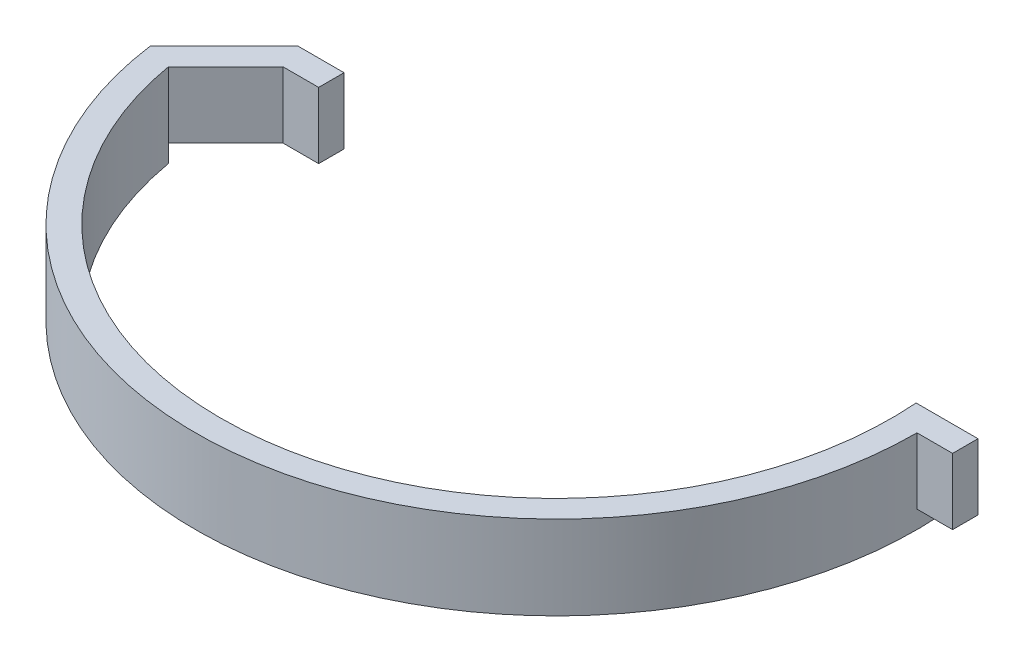
ISO-10303-21;
HEADER;
FILE_DESCRIPTION(('STEP AP214'),'2;1');
FILE_NAME('part.step','',(''),(''),'','','');
FILE_SCHEMA(('AUTOMOTIVE_DESIGN { 1 0 10303 214 1 1 1 1 }'));
ENDSEC;
DATA;
#1=APPLICATION_CONTEXT('core data for automotive mechanical design processes');
#2=APPLICATION_PROTOCOL_DEFINITION('international standard','automotive_design',2000,#1);
#3=PRODUCT_CONTEXT('',#1,'mechanical');
#4=PRODUCT('Part','Part','',(#3));
#5=PRODUCT_RELATED_PRODUCT_CATEGORY('part','',(#4));
#6=PRODUCT_DEFINITION_FORMATION('','',#4);
#7=PRODUCT_DEFINITION_CONTEXT('part definition',#1,'design');
#8=PRODUCT_DEFINITION('design','',#6,#7);
#9=PRODUCT_DEFINITION_SHAPE('','',#8);
#10=(LENGTH_UNIT() NAMED_UNIT(*) SI_UNIT(.MILLI.,.METRE.));
#11=(NAMED_UNIT(*) PLANE_ANGLE_UNIT() SI_UNIT($,.RADIAN.));
#12=(NAMED_UNIT(*) SI_UNIT($,.STERADIAN.) SOLID_ANGLE_UNIT());
#13=UNCERTAINTY_MEASURE_WITH_UNIT(LENGTH_MEASURE(1.E-05),#10,'distance_accuracy_value','');
#14=(GEOMETRIC_REPRESENTATION_CONTEXT(3) GLOBAL_UNCERTAINTY_ASSIGNED_CONTEXT((#13)) GLOBAL_UNIT_ASSIGNED_CONTEXT((#10,
#11,#12)) REPRESENTATION_CONTEXT('',''));
#15=CARTESIAN_POINT('',(0.,0.,0.));
#16=DIRECTION('',(0.,0.,1.));
#17=DIRECTION('',(1.,0.,0.));
#18=AXIS2_PLACEMENT_3D('',#15,#16,#17);
#19=CARTESIAN_POINT('',(0.,0.,5.));
#20=DIRECTION('',(0.,1.,0.));
#21=DIRECTION('',(0.,0.,1.));
#22=AXIS2_PLACEMENT_3D('',#19,#20,#21);
#23=PLANE('',#22);
#24=DIRECTION('',(0.707106781186548,0.,0.707106781186547));
#25=VECTOR('',#24,1.);
#26=CARTESIAN_POINT('',(-65.0275000698589,0.,16.2882343466328));
#27=LINE('',#26,#25);
#28=CARTESIAN_POINT('',(-68.5630339757917,0.,12.7527004407001));
#29=VERTEX_POINT('',#28);
#30=CARTESIAN_POINT('',(-65.0275000698589,0.,16.2882343466328));
#31=VERTEX_POINT('',#30);
#32=EDGE_CURVE('E208',#29,#31,#27,.T.);
#33=ORIENTED_EDGE('',*,*,#32,.F.);
#34=DIRECTION('',(-0.707106781186547,0.,0.707106781186549));
#35=VECTOR('',#34,1.);
#36=CARTESIAN_POINT('',(-70.3435881373644,0.,14.5332546022729));
#37=LINE('',#36,#35);
#38=CARTESIAN_POINT('',(-55.8103335350916,0.,0.));
#39=VERTEX_POINT('',#38);
#40=EDGE_CURVE('E143',#39,#29,#37,.T.);
#41=ORIENTED_EDGE('',*,*,#40,.F.);
#42=DIRECTION('',(-1.,0.,0.));
#43=VECTOR('',#42,1.);
#44=CARTESIAN_POINT('',(-55.8103335350916,0.,0.));
#45=LINE('',#44,#43);
#46=CARTESIAN_POINT('',(-46.7392657232261,0.,0.));
#47=VERTEX_POINT('',#46);
#48=EDGE_CURVE('E141',#47,#39,#45,.T.);
#49=ORIENTED_EDGE('',*,*,#48,.F.);
#50=DIRECTION('',(0.,0.,-1.));
#51=VECTOR('',#50,1.);
#52=CARTESIAN_POINT('',(-46.7392657232261,0.,0.));
#53=LINE('',#52,#51);
#54=CARTESIAN_POINT('',(-46.7392657232261,0.,5.00000000000001));
#55=VERTEX_POINT('',#54);
#56=EDGE_CURVE('E139',#55,#47,#53,.T.);
#57=ORIENTED_EDGE('',*,*,#56,.F.);
#58=DIRECTION('',(1.,0.,0.));
#59=VECTOR('',#58,1.);
#60=CARTESIAN_POINT('',(-46.7392657232261,0.,5.00000000000001));
#61=LINE('',#60,#59);
#62=CARTESIAN_POINT('',(-53.7392657232261,0.,5.00000000000001));
#63=VERTEX_POINT('',#62);
#64=EDGE_CURVE('E136',#63,#55,#61,.T.);
#65=ORIENTED_EDGE('',*,*,#64,.F.);
#66=DIRECTION('',(0.707106781186546,0.,-0.707106781186549));
#67=VECTOR('',#66,1.);
#68=CARTESIAN_POINT('',(-53.7392657232261,0.,5.00000000000001));
#69=LINE('',#68,#67);
#70=EDGE_CURVE('E134',#31,#63,#69,.T.);
#71=ORIENTED_EDGE('',*,*,#70,.F.);
#72=EDGE_LOOP('',(#33,#41,#49,#57,#65,#71));
#73=FACE_BOUND('',#72,.T.);
#74=ADVANCED_FACE('F34',(#73),#23,.F.);
#75=CARTESIAN_POINT('',(0.,0.,5.));
#76=DIRECTION('',(0.,-1.,0.));
#77=DIRECTION('',(0.,0.,1.));
#78=AXIS2_PLACEMENT_3D('',#75,#76,#77);
#79=CIRCLE('',#78,70.9866419500945);
#80=CARTESIAN_POINT('',(70.8103335350916,0.,0.));
#81=VERTEX_POINT('',#80);
#82=CARTESIAN_POINT('',(70.9866419500945,0.,5.));
#83=VERTEX_POINT('',#82);
#84=EDGE_CURVE('E212',#81,#83,#79,.T.);
#85=ORIENTED_EDGE('',*,*,#84,.F.);
#86=DIRECTION('',(-1.,0.,0.));
#87=VECTOR('',#86,1.);
#88=CARTESIAN_POINT('',(65.8103335350916,0.,0.));
#89=LINE('',#88,#87);
#90=CARTESIAN_POINT('',(77.9866419500945,0.,0.));
#91=VERTEX_POINT('',#90);
#92=EDGE_CURVE('E148',#91,#81,#89,.T.);
#93=ORIENTED_EDGE('',*,*,#92,.F.);
#94=DIRECTION('',(0.,0.,-1.));
#95=VECTOR('',#94,1.);
#96=CARTESIAN_POINT('',(77.9866419500945,0.,0.));
#97=LINE('',#96,#95);
#98=CARTESIAN_POINT('',(77.9866419500945,0.,4.99999999999999));
#99=VERTEX_POINT('',#98);
#100=EDGE_CURVE('E85',#99,#91,#97,.T.);
#101=ORIENTED_EDGE('',*,*,#100,.F.);
#102=DIRECTION('',(1.,0.,0.));
#103=VECTOR('',#102,1.);
#104=CARTESIAN_POINT('',(77.9866419500945,0.,4.99999999999999));
#105=LINE('',#104,#103);
#106=EDGE_CURVE('E78',#83,#99,#105,.T.);
#107=ORIENTED_EDGE('',*,*,#106,.F.);
#108=EDGE_LOOP('',(#85,#93,#101,#107));
#109=FACE_BOUND('',#108,.T.);
#110=ADVANCED_FACE('F259',(#109),#23,.F.);
#111=CARTESIAN_POINT('',(0.,13.,5.));
#112=DIRECTION('',(0.,-1.,0.));
#113=DIRECTION('',(0.,0.,-1.));
#114=AXIS2_PLACEMENT_3D('',#111,#112,#113);
#115=CYLINDRICAL_SURFACE('',#114,66.);
#116=DIRECTION('',(0.,-1.,0.));
#117=VECTOR('',#116,1.);
#118=CARTESIAN_POINT('',(65.8103335350916,13.,0.));
#119=LINE('',#118,#117);
#120=CARTESIAN_POINT('',(65.8103335350916,13.,0.));
#121=VERTEX_POINT('',#120);
#122=CARTESIAN_POINT('',(65.8103335350916,-3.5,0.));
#123=VERTEX_POINT('',#122);
#124=EDGE_CURVE('E130',#121,#123,#119,.T.);
#125=ORIENTED_EDGE('',*,*,#124,.T.);
#126=CARTESIAN_POINT('',(0.,-3.5,5.));
#127=DIRECTION('',(0.,1.,0.));
#128=DIRECTION('',(0.,0.,-1.));
#129=AXIS2_PLACEMENT_3D('',#126,#127,#128);
#130=CIRCLE('',#129,66.);
#131=CARTESIAN_POINT('',(-65.0275000698589,-3.5,16.2882343466328));
#132=VERTEX_POINT('',#131);
#133=EDGE_CURVE('E211',#132,#123,#130,.T.);
#134=ORIENTED_EDGE('',*,*,#133,.F.);
#135=DIRECTION('',(0.,1.,0.));
#136=VECTOR('',#135,1.);
#137=CARTESIAN_POINT('',(-65.0275000698589,-3.5,16.2882343466328));
#138=LINE('',#137,#136);
#139=EDGE_CURVE('E204',#132,#31,#138,.T.);
#140=ORIENTED_EDGE('',*,*,#139,.T.);
#141=DIRECTION('',(0.,-1.,0.));
#142=VECTOR('',#141,1.);
#143=CARTESIAN_POINT('',(-65.0275000698589,13.,16.2882343466328));
#144=LINE('',#143,#142);
#145=CARTESIAN_POINT('',(-65.0275000698589,13.,16.2882343466328));
#146=VERTEX_POINT('',#145);
#147=EDGE_CURVE('E11',#146,#31,#144,.T.);
#148=ORIENTED_EDGE('',*,*,#147,.F.);
#149=CARTESIAN_POINT('',(0.,13.,5.));
#150=DIRECTION('',(0.,-1.,0.));
#151=DIRECTION('',(0.,0.,1.));
#152=AXIS2_PLACEMENT_3D('',#149,#150,#151);
#153=CIRCLE('',#152,66.);
#154=EDGE_CURVE('E151',#121,#146,#153,.T.);
#155=ORIENTED_EDGE('',*,*,#154,.F.);
#156=EDGE_LOOP('',(#125,#134,#140,#148,#155));
#157=FACE_BOUND('',#156,.T.);
#158=ADVANCED_FACE('F36',(#157),#115,.F.);
#159=CARTESIAN_POINT('',(-53.7392657232261,13.,5.00000000000001));
#160=DIRECTION('',(-0.707106781186549,0.,-0.707106781186546));
#161=DIRECTION('',(-0.707106781186546,0.,0.707106781186549));
#162=AXIS2_PLACEMENT_3D('',#159,#160,#161);
#163=PLANE('',#162);
#164=ORIENTED_EDGE('',*,*,#70,.T.);
#165=DIRECTION('',(0.,-1.,0.));
#166=VECTOR('',#165,1.);
#167=CARTESIAN_POINT('',(-53.7392657232261,13.,5.00000000000001));
#168=LINE('',#167,#166);
#169=CARTESIAN_POINT('',(-53.7392657232261,13.,5.00000000000001));
#170=VERTEX_POINT('',#169);
#171=EDGE_CURVE('E43',#170,#63,#168,.T.);
#172=ORIENTED_EDGE('',*,*,#171,.F.);
#173=DIRECTION('',(0.707106781186546,0.,-0.707106781186549));
#174=VECTOR('',#173,1.);
#175=CARTESIAN_POINT('',(-53.7392657232261,13.,5.00000000000001));
#176=LINE('',#175,#174);
#177=EDGE_CURVE('E93',#146,#170,#176,.T.);
#178=ORIENTED_EDGE('',*,*,#177,.F.);
#179=ORIENTED_EDGE('',*,*,#147,.T.);
#180=EDGE_LOOP('',(#164,#172,#178,#179));
#181=FACE_BOUND('',#180,.T.);
#182=ADVANCED_FACE('F263',(#181),#163,.F.);
#183=CARTESIAN_POINT('',(-46.7392657232261,13.,5.00000000000001));
#184=DIRECTION('',(0.,0.,-1.));
#185=DIRECTION('',(-1.,0.,0.));
#186=AXIS2_PLACEMENT_3D('',#183,#184,#185);
#187=PLANE('',#186);
#188=ORIENTED_EDGE('',*,*,#64,.T.);
#189=DIRECTION('',(0.,-1.,0.));
#190=VECTOR('',#189,1.);
#191=CARTESIAN_POINT('',(-46.7392657232261,13.,5.00000000000001));
#192=LINE('',#191,#190);
#193=CARTESIAN_POINT('',(-46.7392657232261,13.,5.00000000000001));
#194=VERTEX_POINT('',#193);
#195=EDGE_CURVE('E165',#194,#55,#192,.T.);
#196=ORIENTED_EDGE('',*,*,#195,.F.);
#197=DIRECTION('',(1.,0.,0.));
#198=VECTOR('',#197,1.);
#199=CARTESIAN_POINT('',(-46.7392657232261,13.,5.00000000000001));
#200=LINE('',#199,#198);
#201=EDGE_CURVE('E173',#170,#194,#200,.T.);
#202=ORIENTED_EDGE('',*,*,#201,.F.);
#203=ORIENTED_EDGE('',*,*,#171,.T.);
#204=EDGE_LOOP('',(#188,#196,#202,#203));
#205=FACE_BOUND('',#204,.T.);
#206=ADVANCED_FACE('F171',(#205),#187,.F.);
#207=CARTESIAN_POINT('',(-46.7392657232261,13.,0.));
#208=DIRECTION('',(-1.,0.,0.));
#209=DIRECTION('',(0.,0.,1.));
#210=AXIS2_PLACEMENT_3D('',#207,#208,#209);
#211=PLANE('',#210);
#212=ORIENTED_EDGE('',*,*,#56,.T.);
#213=DIRECTION('',(0.,-1.,0.));
#214=VECTOR('',#213,1.);
#215=CARTESIAN_POINT('',(-46.7392657232261,13.,0.));
#216=LINE('',#215,#214);
#217=CARTESIAN_POINT('',(-46.7392657232261,13.,0.));
#218=VERTEX_POINT('',#217);
#219=EDGE_CURVE('E162',#218,#47,#216,.T.);
#220=ORIENTED_EDGE('',*,*,#219,.F.);
#221=DIRECTION('',(0.,0.,-1.));
#222=VECTOR('',#221,1.);
#223=CARTESIAN_POINT('',(-46.7392657232261,13.,0.));
#224=LINE('',#223,#222);
#225=EDGE_CURVE('E191',#194,#218,#224,.T.);
#226=ORIENTED_EDGE('',*,*,#225,.F.);
#227=ORIENTED_EDGE('',*,*,#195,.T.);
#228=EDGE_LOOP('',(#212,#220,#226,#227));
#229=FACE_BOUND('',#228,.T.);
#230=ADVANCED_FACE('F182',(#229),#211,.F.);
#231=CARTESIAN_POINT('',(-55.8103335350916,13.,0.));
#232=DIRECTION('',(0.,0.,1.));
#233=DIRECTION('',(1.,0.,0.));
#234=AXIS2_PLACEMENT_3D('',#231,#232,#233);
#235=PLANE('',#234);
#236=ORIENTED_EDGE('',*,*,#48,.T.);
#237=DIRECTION('',(0.,-1.,0.));
#238=VECTOR('',#237,1.);
#239=CARTESIAN_POINT('',(-55.8103335350916,13.,0.));
#240=LINE('',#239,#238);
#241=CARTESIAN_POINT('',(-55.8103335350916,13.,0.));
#242=VERTEX_POINT('',#241);
#243=EDGE_CURVE('E159',#242,#39,#240,.T.);
#244=ORIENTED_EDGE('',*,*,#243,.F.);
#245=DIRECTION('',(-1.,0.,0.));
#246=VECTOR('',#245,1.);
#247=CARTESIAN_POINT('',(-55.8103335350916,13.,0.));
#248=LINE('',#247,#246);
#249=EDGE_CURVE('E188',#218,#242,#248,.T.);
#250=ORIENTED_EDGE('',*,*,#249,.F.);
#251=ORIENTED_EDGE('',*,*,#219,.T.);
#252=EDGE_LOOP('',(#236,#244,#250,#251));
#253=FACE_BOUND('',#252,.T.);
#254=ADVANCED_FACE('F186',(#253),#235,.F.);
#255=CARTESIAN_POINT('',(-70.3435881373644,13.,14.5332546022729));
#256=DIRECTION('',(0.707106781186548,0.,0.707106781186546));
#257=DIRECTION('',(0.707106781186547,0.,-0.707106781186549));
#258=AXIS2_PLACEMENT_3D('',#255,#256,#257);
#259=PLANE('',#258);
#260=ORIENTED_EDGE('',*,*,#40,.T.);
#261=DIRECTION('',(0.,1.,0.));
#262=VECTOR('',#261,1.);
#263=CARTESIAN_POINT('',(-68.5630339757917,-3.5,12.7527004407001));
#264=LINE('',#263,#262);
#265=CARTESIAN_POINT('',(-68.5630339757917,-3.5,12.7527004407001));
#266=VERTEX_POINT('',#265);
#267=EDGE_CURVE('E201',#266,#29,#264,.T.);
#268=ORIENTED_EDGE('',*,*,#267,.F.);
#269=DIRECTION('',(0.707106781186548,0.,-0.707106781186548));
#270=VECTOR('',#269,1.);
#271=CARTESIAN_POINT('',(-68.5630339757917,-3.5,12.7527004407001));
#272=LINE('',#271,#270);
#273=CARTESIAN_POINT('',(-70.3435881373644,-3.5,14.5332546022729));
#274=VERTEX_POINT('',#273);
#275=EDGE_CURVE('E216',#274,#266,#272,.T.);
#276=ORIENTED_EDGE('',*,*,#275,.F.);
#277=DIRECTION('',(0.,-1.,0.));
#278=VECTOR('',#277,1.);
#279=CARTESIAN_POINT('',(-70.3435881373644,13.,14.5332546022729));
#280=LINE('',#279,#278);
#281=CARTESIAN_POINT('',(-70.3435881373644,13.,14.5332546022729));
#282=VERTEX_POINT('',#281);
#283=EDGE_CURVE('E156',#282,#274,#280,.T.);
#284=ORIENTED_EDGE('',*,*,#283,.F.);
#285=DIRECTION('',(-0.707106781186547,0.,0.707106781186549));
#286=VECTOR('',#285,1.);
#287=CARTESIAN_POINT('',(-70.3435881373644,13.,14.5332546022729));
#288=LINE('',#287,#286);
#289=EDGE_CURVE('E190',#242,#282,#288,.T.);
#290=ORIENTED_EDGE('',*,*,#289,.F.);
#291=ORIENTED_EDGE('',*,*,#243,.T.);
#292=EDGE_LOOP('',(#260,#268,#276,#284,#290,#291));
#293=FACE_BOUND('',#292,.T.);
#294=ADVANCED_FACE('F251',(#293),#259,.F.);
#295=CARTESIAN_POINT('',(0.,13.,5.));
#296=DIRECTION('',(0.,-1.,0.));
#297=DIRECTION('',(0.,0.,-1.));
#298=AXIS2_PLACEMENT_3D('',#295,#296,#297);
#299=CYLINDRICAL_SURFACE('',#298,70.9866419500945);
#300=ORIENTED_EDGE('',*,*,#283,.T.);
#301=CARTESIAN_POINT('',(0.,-3.5,5.));
#302=DIRECTION('',(0.,-1.,0.));
#303=DIRECTION('',(0.,0.,1.));
#304=AXIS2_PLACEMENT_3D('',#301,#302,#303);
#305=CIRCLE('',#304,70.9866419500945);
#306=CARTESIAN_POINT('',(70.8103335350916,-3.5,0.));
#307=VERTEX_POINT('',#306);
#308=EDGE_CURVE('E219',#307,#274,#305,.T.);
#309=ORIENTED_EDGE('',*,*,#308,.F.);
#310=DIRECTION('',(0.,1.,0.));
#311=VECTOR('',#310,1.);
#312=CARTESIAN_POINT('',(70.8103335350916,-3.5,0.));
#313=LINE('',#312,#311);
#314=EDGE_CURVE('E137',#307,#81,#313,.T.);
#315=ORIENTED_EDGE('',*,*,#314,.T.);
#316=ORIENTED_EDGE('',*,*,#84,.T.);
#317=DIRECTION('',(0.,-1.,0.));
#318=VECTOR('',#317,1.);
#319=CARTESIAN_POINT('',(70.9866419500945,13.,5.));
#320=LINE('',#319,#318);
#321=CARTESIAN_POINT('',(70.9866419500945,13.,5.));
#322=VERTEX_POINT('',#321);
#323=EDGE_CURVE('E125',#322,#83,#320,.T.);
#324=ORIENTED_EDGE('',*,*,#323,.F.);
#325=CARTESIAN_POINT('',(0.,13.,5.));
#326=DIRECTION('',(0.,1.,0.));
#327=DIRECTION('',(0.,0.,1.));
#328=AXIS2_PLACEMENT_3D('',#325,#326,#327);
#329=CIRCLE('',#328,70.9866419500945);
#330=EDGE_CURVE('E120',#282,#322,#329,.T.);
#331=ORIENTED_EDGE('',*,*,#330,.F.);
#332=EDGE_LOOP('',(#300,#309,#315,#316,#324,#331));
#333=FACE_BOUND('',#332,.T.);
#334=ADVANCED_FACE('F256',(#333),#299,.T.);
#335=CARTESIAN_POINT('',(77.9866419500945,13.,4.99999999999999));
#336=DIRECTION('',(0.,0.,-1.));
#337=DIRECTION('',(-1.,0.,0.));
#338=AXIS2_PLACEMENT_3D('',#335,#336,#337);
#339=PLANE('',#338);
#340=ORIENTED_EDGE('',*,*,#106,.T.);
#341=DIRECTION('',(0.,-1.,0.));
#342=VECTOR('',#341,1.);
#343=CARTESIAN_POINT('',(77.9866419500945,13.,4.99999999999999));
#344=LINE('',#343,#342);
#345=CARTESIAN_POINT('',(77.9866419500945,13.,4.99999999999999));
#346=VERTEX_POINT('',#345);
#347=EDGE_CURVE('E123',#346,#99,#344,.T.);
#348=ORIENTED_EDGE('',*,*,#347,.F.);
#349=DIRECTION('',(1.,0.,0.));
#350=VECTOR('',#349,1.);
#351=CARTESIAN_POINT('',(77.9866419500945,13.,4.99999999999999));
#352=LINE('',#351,#350);
#353=EDGE_CURVE('E115',#322,#346,#352,.T.);
#354=ORIENTED_EDGE('',*,*,#353,.F.);
#355=ORIENTED_EDGE('',*,*,#323,.T.);
#356=EDGE_LOOP('',(#340,#348,#354,#355));
#357=FACE_BOUND('',#356,.T.);
#358=ADVANCED_FACE('F124',(#357),#339,.F.);
#359=CARTESIAN_POINT('',(77.9866419500945,13.,0.));
#360=DIRECTION('',(-1.,0.,0.));
#361=DIRECTION('',(0.,0.,1.));
#362=AXIS2_PLACEMENT_3D('',#359,#360,#361);
#363=PLANE('',#362);
#364=ORIENTED_EDGE('',*,*,#100,.T.);
#365=DIRECTION('',(0.,-1.,0.));
#366=VECTOR('',#365,1.);
#367=CARTESIAN_POINT('',(77.9866419500945,13.,0.));
#368=LINE('',#367,#366);
#369=CARTESIAN_POINT('',(77.9866419500945,13.,0.));
#370=VERTEX_POINT('',#369);
#371=EDGE_CURVE('E126',#370,#91,#368,.T.);
#372=ORIENTED_EDGE('',*,*,#371,.F.);
#373=DIRECTION('',(0.,0.,-1.));
#374=VECTOR('',#373,1.);
#375=CARTESIAN_POINT('',(77.9866419500945,13.,0.));
#376=LINE('',#375,#374);
#377=EDGE_CURVE('E118',#346,#370,#376,.T.);
#378=ORIENTED_EDGE('',*,*,#377,.F.);
#379=ORIENTED_EDGE('',*,*,#347,.T.);
#380=EDGE_LOOP('',(#364,#372,#378,#379));
#381=FACE_BOUND('',#380,.T.);
#382=ADVANCED_FACE('F128',(#381),#363,.F.);
#383=CARTESIAN_POINT('',(65.8103335350916,13.,0.));
#384=DIRECTION('',(0.,0.,1.));
#385=DIRECTION('',(1.,0.,0.));
#386=AXIS2_PLACEMENT_3D('',#383,#384,#385);
#387=PLANE('',#386);
#388=ORIENTED_EDGE('',*,*,#92,.T.);
#389=ORIENTED_EDGE('',*,*,#314,.F.);
#390=DIRECTION('',(1.,0.,0.));
#391=VECTOR('',#390,1.);
#392=CARTESIAN_POINT('',(65.8103335350916,-3.5,0.));
#393=LINE('',#392,#391);
#394=EDGE_CURVE('E222',#123,#307,#393,.T.);
#395=ORIENTED_EDGE('',*,*,#394,.F.);
#396=ORIENTED_EDGE('',*,*,#124,.F.);
#397=DIRECTION('',(-1.,0.,0.));
#398=VECTOR('',#397,1.);
#399=CARTESIAN_POINT('',(65.8103335350916,13.,0.));
#400=LINE('',#399,#398);
#401=EDGE_CURVE('E51',#370,#121,#400,.T.);
#402=ORIENTED_EDGE('',*,*,#401,.F.);
#403=ORIENTED_EDGE('',*,*,#371,.T.);
#404=EDGE_LOOP('',(#388,#389,#395,#396,#402,#403));
#405=FACE_BOUND('',#404,.T.);
#406=ADVANCED_FACE('F262',(#405),#387,.F.);
#407=CARTESIAN_POINT('',(0.,13.,5.));
#408=DIRECTION('',(0.,1.,0.));
#409=DIRECTION('',(0.,0.,1.));
#410=AXIS2_PLACEMENT_3D('',#407,#408,#409);
#411=PLANE('',#410);
#412=ORIENTED_EDGE('',*,*,#154,.T.);
#413=ORIENTED_EDGE('',*,*,#177,.T.);
#414=ORIENTED_EDGE('',*,*,#201,.T.);
#415=ORIENTED_EDGE('',*,*,#225,.T.);
#416=ORIENTED_EDGE('',*,*,#249,.T.);
#417=ORIENTED_EDGE('',*,*,#289,.T.);
#418=ORIENTED_EDGE('',*,*,#330,.T.);
#419=ORIENTED_EDGE('',*,*,#353,.T.);
#420=ORIENTED_EDGE('',*,*,#377,.T.);
#421=ORIENTED_EDGE('',*,*,#401,.T.);
#422=EDGE_LOOP('',(#412,#413,#414,#415,#416,#417,#418,#419,#420,#421));
#423=FACE_BOUND('',#422,.T.);
#424=ADVANCED_FACE('F116',(#423),#411,.T.);
#425=CARTESIAN_POINT('',(-65.0275000698589,-3.5,16.2882343466328));
#426=DIRECTION('',(-0.707106781186547,0.,0.707106781186548));
#427=DIRECTION('',(0.707106781186548,0.,0.707106781186547));
#428=AXIS2_PLACEMENT_3D('',#425,#426,#427);
#429=PLANE('',#428);
#430=ORIENTED_EDGE('',*,*,#32,.T.);
#431=ORIENTED_EDGE('',*,*,#139,.F.);
#432=DIRECTION('',(0.707106781186548,0.,0.707106781186547));
#433=VECTOR('',#432,1.);
#434=CARTESIAN_POINT('',(-65.0275000698589,-3.5,16.2882343466328));
#435=LINE('',#434,#433);
#436=EDGE_CURVE('E207',#266,#132,#435,.T.);
#437=ORIENTED_EDGE('',*,*,#436,.F.);
#438=ORIENTED_EDGE('',*,*,#267,.T.);
#439=EDGE_LOOP('',(#430,#431,#437,#438));
#440=FACE_BOUND('',#439,.T.);
#441=ADVANCED_FACE('F249',(#440),#429,.F.);
#442=CARTESIAN_POINT('',(0.,-3.5,5.));
#443=DIRECTION('',(0.,-1.,0.));
#444=DIRECTION('',(0.,0.,-1.));
#445=AXIS2_PLACEMENT_3D('',#442,#443,#444);
#446=PLANE('',#445);
#447=ORIENTED_EDGE('',*,*,#133,.T.);
#448=ORIENTED_EDGE('',*,*,#394,.T.);
#449=ORIENTED_EDGE('',*,*,#308,.T.);
#450=ORIENTED_EDGE('',*,*,#275,.T.);
#451=ORIENTED_EDGE('',*,*,#436,.T.);
#452=EDGE_LOOP('',(#447,#448,#449,#450,#451));
#453=FACE_BOUND('',#452,.T.);
#454=ADVANCED_FACE('F229',(#453),#446,.T.);
#455=CLOSED_SHELL('',(#74,#110,#158,#182,#206,#230,#254,#294,#334,#358,#382,#406,#424,#441,#454));
#456=MANIFOLD_SOLID_BREP('B2',#455);
#457=ADVANCED_BREP_SHAPE_REPRESENTATION('',(#18,#456),#14);
#458=SHAPE_DEFINITION_REPRESENTATION(#9,#457);
ENDSEC;
END-ISO-10303-21;
